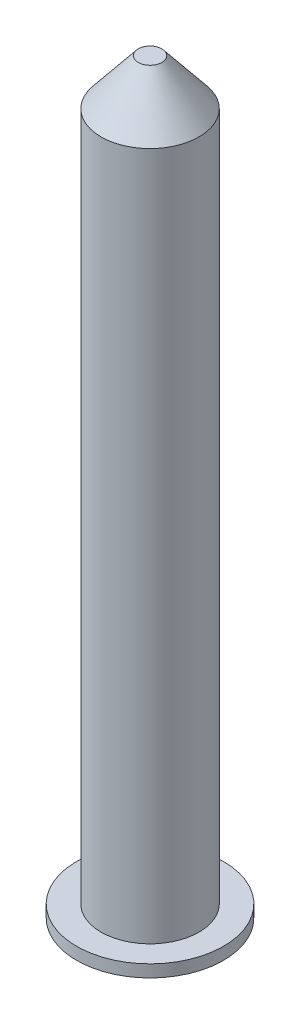
ISO-10303-21;
HEADER;
FILE_DESCRIPTION(('STEP AP214'),'2;1');
FILE_NAME('part.step','',(''),(''),'','','');
FILE_SCHEMA(('AUTOMOTIVE_DESIGN { 1 0 10303 214 1 1 1 1 }'));
ENDSEC;
DATA;
#1=APPLICATION_CONTEXT('core data for automotive mechanical design processes');
#2=APPLICATION_PROTOCOL_DEFINITION('international standard','automotive_design',2000,#1);
#3=PRODUCT_CONTEXT('',#1,'mechanical');
#4=PRODUCT('Part','Part','',(#3));
#5=PRODUCT_RELATED_PRODUCT_CATEGORY('part','',(#4));
#6=PRODUCT_DEFINITION_FORMATION('','',#4);
#7=PRODUCT_DEFINITION_CONTEXT('part definition',#1,'design');
#8=PRODUCT_DEFINITION('design','',#6,#7);
#9=PRODUCT_DEFINITION_SHAPE('','',#8);
#10=(LENGTH_UNIT() NAMED_UNIT(*) SI_UNIT(.MILLI.,.METRE.));
#11=(NAMED_UNIT(*) PLANE_ANGLE_UNIT() SI_UNIT($,.RADIAN.));
#12=(NAMED_UNIT(*) SI_UNIT($,.STERADIAN.) SOLID_ANGLE_UNIT());
#13=UNCERTAINTY_MEASURE_WITH_UNIT(LENGTH_MEASURE(1.E-05),#10,'distance_accuracy_value','');
#14=(GEOMETRIC_REPRESENTATION_CONTEXT(3) GLOBAL_UNCERTAINTY_ASSIGNED_CONTEXT((#13)) GLOBAL_UNIT_ASSIGNED_CONTEXT((#10,
#11,#12)) REPRESENTATION_CONTEXT('',''));
#15=CARTESIAN_POINT('',(0.,0.,0.));
#16=DIRECTION('',(0.,0.,1.));
#17=DIRECTION('',(1.,0.,0.));
#18=AXIS2_PLACEMENT_3D('',#15,#16,#17);
#19=CARTESIAN_POINT('',(0.,38.1,0.));
#20=DIRECTION('',(0.,-1.,0.));
#21=DIRECTION('',(0.,0.,-1.));
#22=AXIS2_PLACEMENT_3D('',#19,#20,#21);
#23=CYLINDRICAL_SURFACE('',#22,2.54);
#24=CARTESIAN_POINT('',(0.,35.72,0.));
#25=DIRECTION('',(0.,1.,0.));
#26=DIRECTION('',(0.,0.,1.));
#27=AXIS2_PLACEMENT_3D('',#24,#25,#26);
#28=CIRCLE('',#27,2.54);
#29=CARTESIAN_POINT('',(0.,35.72,2.54));
#30=VERTEX_POINT('',#29);
#31=EDGE_CURVE('E10',#30,#30,#28,.F.);
#32=ORIENTED_EDGE('',*,*,#31,.T.);
#33=EDGE_LOOP('',(#32));
#34=FACE_BOUND('',#33,.T.);
#35=CARTESIAN_POINT('',(0.,0.,0.));
#36=DIRECTION('',(0.,1.,0.));
#37=DIRECTION('',(0.,0.,1.));
#38=AXIS2_PLACEMENT_3D('',#35,#36,#37);
#39=CIRCLE('',#38,2.54);
#40=CARTESIAN_POINT('',(0.,0.,2.54));
#41=VERTEX_POINT('',#40);
#42=EDGE_CURVE('E53',#41,#41,#39,.T.);
#43=ORIENTED_EDGE('',*,*,#42,.T.);
#44=EDGE_LOOP('',(#43));
#45=FACE_BOUND('',#44,.T.);
#46=ADVANCED_FACE('F39',(#34,#45),#23,.T.);
#47=CARTESIAN_POINT('',(0.,38.1,0.));
#48=DIRECTION('',(0.,1.,0.));
#49=DIRECTION('',(0.,0.,1.));
#50=AXIS2_PLACEMENT_3D('',#47,#48,#49);
#51=PLANE('',#50);
#52=CARTESIAN_POINT('',(0.,38.1,0.));
#53=DIRECTION('',(0.,1.,0.));
#54=DIRECTION('',(0.,0.,1.));
#55=AXIS2_PLACEMENT_3D('',#52,#53,#54);
#56=CIRCLE('',#55,0.612714000995908);
#57=CARTESIAN_POINT('',(0.,38.1,0.612714000995908));
#58=VERTEX_POINT('',#57);
#59=EDGE_CURVE('E48',#58,#58,#56,.T.);
#60=ORIENTED_EDGE('',*,*,#59,.T.);
#61=EDGE_LOOP('',(#60));
#62=FACE_BOUND('',#61,.T.);
#63=ADVANCED_FACE('F87',(#62),#51,.T.);
#64=CARTESIAN_POINT('',(0.,38.1,0.));
#65=DIRECTION('',(0.,-1.,0.));
#66=DIRECTION('',(0.,0.,-1.));
#67=AXIS2_PLACEMENT_3D('',#64,#65,#66);
#68=CONICAL_SURFACE('',#67,0.612714000995908,0.680678408277788);
#69=ORIENTED_EDGE('',*,*,#31,.F.);
#70=EDGE_LOOP('',(#69));
#71=FACE_BOUND('',#70,.T.);
#72=ORIENTED_EDGE('',*,*,#59,.F.);
#73=EDGE_LOOP('',(#72));
#74=FACE_BOUND('',#73,.T.);
#75=ADVANCED_FACE('F42',(#71,#74),#68,.T.);
#76=CARTESIAN_POINT('',(0.,-0.635,0.));
#77=DIRECTION('',(0.,1.,0.));
#78=DIRECTION('',(0.,0.,1.));
#79=AXIS2_PLACEMENT_3D('',#76,#77,#78);
#80=CYLINDRICAL_SURFACE('',#79,3.81);
#81=CARTESIAN_POINT('',(0.,-0.635,0.));
#82=DIRECTION('',(0.,-1.,0.));
#83=DIRECTION('',(0.,0.,-1.));
#84=AXIS2_PLACEMENT_3D('',#81,#82,#83);
#85=CIRCLE('',#84,3.81);
#86=CARTESIAN_POINT('',(0.,-0.635,-3.81));
#87=VERTEX_POINT('',#86);
#88=EDGE_CURVE('E58',#87,#87,#85,.T.);
#89=ORIENTED_EDGE('',*,*,#88,.F.);
#90=EDGE_LOOP('',(#89));
#91=FACE_BOUND('',#90,.T.);
#92=CARTESIAN_POINT('',(0.,0.,0.));
#93=DIRECTION('',(0.,-1.,0.));
#94=DIRECTION('',(0.,0.,-1.));
#95=AXIS2_PLACEMENT_3D('',#92,#93,#94);
#96=CIRCLE('',#95,3.81);
#97=CARTESIAN_POINT('',(0.,0.,-3.81));
#98=VERTEX_POINT('',#97);
#99=EDGE_CURVE('E61',#98,#98,#96,.T.);
#100=ORIENTED_EDGE('',*,*,#99,.T.);
#101=EDGE_LOOP('',(#100));
#102=FACE_BOUND('',#101,.T.);
#103=ADVANCED_FACE('F71',(#91,#102),#80,.T.);
#104=CARTESIAN_POINT('',(0.,-0.635,0.));
#105=DIRECTION('',(0.,-1.,0.));
#106=DIRECTION('',(0.,0.,-1.));
#107=AXIS2_PLACEMENT_3D('',#104,#105,#106);
#108=PLANE('',#107);
#109=ORIENTED_EDGE('',*,*,#88,.T.);
#110=EDGE_LOOP('',(#109));
#111=FACE_BOUND('',#110,.T.);
#112=ADVANCED_FACE('F69',(#111),#108,.T.);
#113=CARTESIAN_POINT('',(0.,0.,0.));
#114=DIRECTION('',(0.,-1.,0.));
#115=DIRECTION('',(0.,0.,-1.));
#116=AXIS2_PLACEMENT_3D('',#113,#114,#115);
#117=PLANE('',#116);
#118=ORIENTED_EDGE('',*,*,#42,.F.);
#119=EDGE_LOOP('',(#118));
#120=FACE_BOUND('',#119,.T.);
#121=ORIENTED_EDGE('',*,*,#99,.F.);
#122=EDGE_LOOP('',(#121));
#123=FACE_BOUND('',#122,.T.);
#124=ADVANCED_FACE('F77',(#120,#123),#117,.F.);
#125=CLOSED_SHELL('',(#46,#63,#75,#103,#112,#124));
#126=MANIFOLD_SOLID_BREP('B2',#125);
#127=ADVANCED_BREP_SHAPE_REPRESENTATION('',(#18,#126),#14);
#128=SHAPE_DEFINITION_REPRESENTATION(#9,#127);
ENDSEC;
END-ISO-10303-21;
